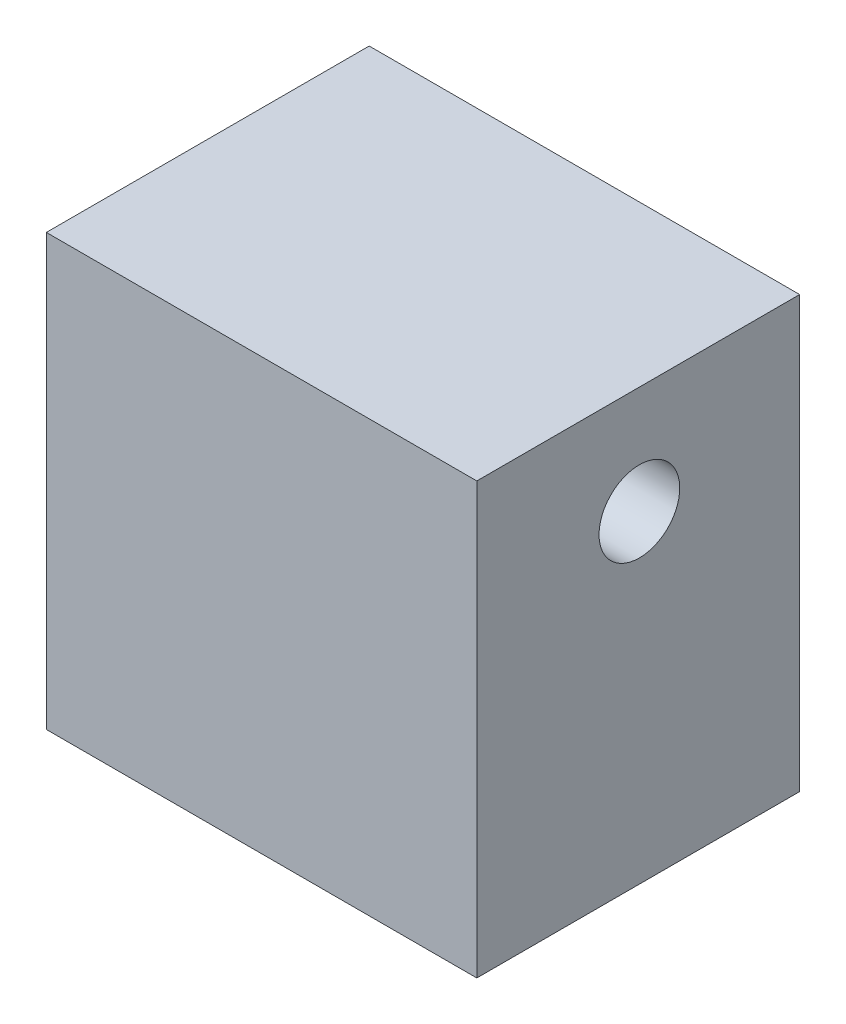
ISO-10303-21;
HEADER;
FILE_DESCRIPTION(('STEP AP214'),'2;1');
FILE_NAME('part.step','',(''),(''),'','','');
FILE_SCHEMA(('AUTOMOTIVE_DESIGN { 1 0 10303 214 1 1 1 1 }'));
ENDSEC;
DATA;
#1=APPLICATION_CONTEXT('core data for automotive mechanical design processes');
#2=APPLICATION_PROTOCOL_DEFINITION('international standard','automotive_design',2000,#1);
#3=PRODUCT_CONTEXT('',#1,'mechanical');
#4=PRODUCT('Part','Part','',(#3));
#5=PRODUCT_RELATED_PRODUCT_CATEGORY('part','',(#4));
#6=PRODUCT_DEFINITION_FORMATION('','',#4);
#7=PRODUCT_DEFINITION_CONTEXT('part definition',#1,'design');
#8=PRODUCT_DEFINITION('design','',#6,#7);
#9=PRODUCT_DEFINITION_SHAPE('','',#8);
#10=(LENGTH_UNIT() NAMED_UNIT(*) SI_UNIT(.MILLI.,.METRE.));
#11=(NAMED_UNIT(*) PLANE_ANGLE_UNIT() SI_UNIT($,.RADIAN.));
#12=(NAMED_UNIT(*) SI_UNIT($,.STERADIAN.) SOLID_ANGLE_UNIT());
#13=UNCERTAINTY_MEASURE_WITH_UNIT(LENGTH_MEASURE(1.E-05),#10,'distance_accuracy_value','');
#14=(GEOMETRIC_REPRESENTATION_CONTEXT(3) GLOBAL_UNCERTAINTY_ASSIGNED_CONTEXT((#13)) GLOBAL_UNIT_ASSIGNED_CONTEXT((#10,
#11,#12)) REPRESENTATION_CONTEXT('',''));
#15=CARTESIAN_POINT('',(0.,0.,0.));
#16=DIRECTION('',(0.,0.,1.));
#17=DIRECTION('',(1.,0.,0.));
#18=AXIS2_PLACEMENT_3D('',#15,#16,#17);
#19=CARTESIAN_POINT('',(-25.4,25.4,38.1));
#20=DIRECTION('',(1.,0.,0.));
#21=DIRECTION('',(0.,1.,0.));
#22=AXIS2_PLACEMENT_3D('',#19,#20,#21);
#23=PLANE('',#22);
#24=CARTESIAN_POINT('',(-25.4,12.7,18.9150285820291));
#25=DIRECTION('',(-1.,0.,0.));
#26=DIRECTION('',(0.,-1.,0.));
#27=AXIS2_PLACEMENT_3D('',#24,#25,#26);
#28=CIRCLE('',#27,4.7625);
#29=CARTESIAN_POINT('',(-25.4,7.9375,18.9150285820291));
#30=VERTEX_POINT('',#29);
#31=EDGE_CURVE('E116',#30,#30,#28,.T.);
#32=ORIENTED_EDGE('',*,*,#31,.F.);
#33=EDGE_LOOP('',(#32));
#34=FACE_BOUND('',#33,.T.);
#35=DIRECTION('',(0.,-1.,0.));
#36=VECTOR('',#35,1.);
#37=CARTESIAN_POINT('',(-25.4,25.4,0.));
#38=LINE('',#37,#36);
#39=CARTESIAN_POINT('',(-25.4,25.4,0.));
#40=VERTEX_POINT('',#39);
#41=CARTESIAN_POINT('',(-25.4,-25.4,0.));
#42=VERTEX_POINT('',#41);
#43=EDGE_CURVE('E96',#40,#42,#38,.T.);
#44=ORIENTED_EDGE('',*,*,#43,.T.);
#45=DIRECTION('',(0.,0.,-1.));
#46=VECTOR('',#45,1.);
#47=CARTESIAN_POINT('',(-25.4,-25.4,38.1));
#48=LINE('',#47,#46);
#49=CARTESIAN_POINT('',(-25.4,-25.4,38.1));
#50=VERTEX_POINT('',#49);
#51=EDGE_CURVE('E11',#50,#42,#48,.T.);
#52=ORIENTED_EDGE('',*,*,#51,.F.);
#53=DIRECTION('',(0.,-1.,0.));
#54=VECTOR('',#53,1.);
#55=CARTESIAN_POINT('',(-25.4,25.4,38.1));
#56=LINE('',#55,#54);
#57=CARTESIAN_POINT('',(-25.4,25.4,38.1));
#58=VERTEX_POINT('',#57);
#59=EDGE_CURVE('E84',#58,#50,#56,.T.);
#60=ORIENTED_EDGE('',*,*,#59,.F.);
#61=DIRECTION('',(0.,0.,-1.));
#62=VECTOR('',#61,1.);
#63=CARTESIAN_POINT('',(-25.4,25.4,38.1));
#64=LINE('',#63,#62);
#65=EDGE_CURVE('E92',#58,#40,#64,.T.);
#66=ORIENTED_EDGE('',*,*,#65,.T.);
#67=EDGE_LOOP('',(#44,#52,#60,#66));
#68=FACE_BOUND('',#67,.T.);
#69=ADVANCED_FACE('F33',(#34,#68),#23,.F.);
#70=CARTESIAN_POINT('',(25.4,-25.4,38.1));
#71=DIRECTION('',(0.,1.,0.));
#72=DIRECTION('',(-1.,0.,0.));
#73=AXIS2_PLACEMENT_3D('',#70,#71,#72);
#74=PLANE('',#73);
#75=CARTESIAN_POINT('',(0.,-25.4,19.05));
#76=DIRECTION('',(0.,-1.,0.));
#77=DIRECTION('',(1.,0.,0.));
#78=AXIS2_PLACEMENT_3D('',#75,#76,#77);
#79=CIRCLE('',#78,5.588);
#80=CARTESIAN_POINT('',(5.588,-25.4,19.05));
#81=VERTEX_POINT('',#80);
#82=EDGE_CURVE('E110',#81,#81,#79,.T.);
#83=ORIENTED_EDGE('',*,*,#82,.F.);
#84=EDGE_LOOP('',(#83));
#85=FACE_BOUND('',#84,.T.);
#86=DIRECTION('',(1.,0.,0.));
#87=VECTOR('',#86,1.);
#88=CARTESIAN_POINT('',(25.4,-25.4,0.));
#89=LINE('',#88,#87);
#90=CARTESIAN_POINT('',(25.4,-25.4,0.));
#91=VERTEX_POINT('',#90);
#92=EDGE_CURVE('E88',#42,#91,#89,.T.);
#93=ORIENTED_EDGE('',*,*,#92,.T.);
#94=DIRECTION('',(0.,0.,-1.));
#95=VECTOR('',#94,1.);
#96=CARTESIAN_POINT('',(25.4,-25.4,38.1));
#97=LINE('',#96,#95);
#98=CARTESIAN_POINT('',(25.4,-25.4,38.1));
#99=VERTEX_POINT('',#98);
#100=EDGE_CURVE('E41',#99,#91,#97,.T.);
#101=ORIENTED_EDGE('',*,*,#100,.F.);
#102=DIRECTION('',(1.,0.,0.));
#103=VECTOR('',#102,1.);
#104=CARTESIAN_POINT('',(25.4,-25.4,38.1));
#105=LINE('',#104,#103);
#106=EDGE_CURVE('E79',#50,#99,#105,.T.);
#107=ORIENTED_EDGE('',*,*,#106,.F.);
#108=ORIENTED_EDGE('',*,*,#51,.T.);
#109=EDGE_LOOP('',(#93,#101,#107,#108));
#110=FACE_BOUND('',#109,.T.);
#111=ADVANCED_FACE('F87',(#85,#110),#74,.F.);
#112=CARTESIAN_POINT('',(25.4,25.4,38.1));
#113=DIRECTION('',(-1.,0.,0.));
#114=DIRECTION('',(0.,-1.,0.));
#115=AXIS2_PLACEMENT_3D('',#112,#113,#114);
#116=PLANE('',#115);
#117=CARTESIAN_POINT('',(25.4,12.7,18.9150285820291));
#118=DIRECTION('',(-1.,0.,0.));
#119=DIRECTION('',(0.,-1.,0.));
#120=AXIS2_PLACEMENT_3D('',#117,#118,#119);
#121=CIRCLE('',#120,4.7625);
#122=CARTESIAN_POINT('',(25.4,7.93750000000001,18.9150285820291));
#123=VERTEX_POINT('',#122);
#124=EDGE_CURVE('E113',#123,#123,#121,.T.);
#125=ORIENTED_EDGE('',*,*,#124,.T.);
#126=EDGE_LOOP('',(#125));
#127=FACE_BOUND('',#126,.T.);
#128=DIRECTION('',(0.,1.,0.));
#129=VECTOR('',#128,1.);
#130=CARTESIAN_POINT('',(25.4,25.4,0.));
#131=LINE('',#130,#129);
#132=CARTESIAN_POINT('',(25.4,25.4,0.));
#133=VERTEX_POINT('',#132);
#134=EDGE_CURVE('E66',#91,#133,#131,.T.);
#135=ORIENTED_EDGE('',*,*,#134,.T.);
#136=DIRECTION('',(0.,0.,-1.));
#137=VECTOR('',#136,1.);
#138=CARTESIAN_POINT('',(25.4,25.4,38.1));
#139=LINE('',#138,#137);
#140=CARTESIAN_POINT('',(25.4,25.4,38.1));
#141=VERTEX_POINT('',#140);
#142=EDGE_CURVE('E89',#141,#133,#139,.T.);
#143=ORIENTED_EDGE('',*,*,#142,.F.);
#144=DIRECTION('',(0.,1.,0.));
#145=VECTOR('',#144,1.);
#146=CARTESIAN_POINT('',(25.4,25.4,38.1));
#147=LINE('',#146,#145);
#148=EDGE_CURVE('E82',#99,#141,#147,.T.);
#149=ORIENTED_EDGE('',*,*,#148,.F.);
#150=ORIENTED_EDGE('',*,*,#100,.T.);
#151=EDGE_LOOP('',(#135,#143,#149,#150));
#152=FACE_BOUND('',#151,.T.);
#153=ADVANCED_FACE('F90',(#127,#152),#116,.F.);
#154=CARTESIAN_POINT('',(25.4,25.4,38.1));
#155=DIRECTION('',(0.,-1.,0.));
#156=DIRECTION('',(1.,0.,0.));
#157=AXIS2_PLACEMENT_3D('',#154,#155,#156);
#158=PLANE('',#157);
#159=DIRECTION('',(-1.,0.,0.));
#160=VECTOR('',#159,1.);
#161=CARTESIAN_POINT('',(25.4,25.4,0.));
#162=LINE('',#161,#160);
#163=EDGE_CURVE('E72',#133,#40,#162,.T.);
#164=ORIENTED_EDGE('',*,*,#163,.T.);
#165=ORIENTED_EDGE('',*,*,#65,.F.);
#166=DIRECTION('',(-1.,0.,0.));
#167=VECTOR('',#166,1.);
#168=CARTESIAN_POINT('',(25.4,25.4,38.1));
#169=LINE('',#168,#167);
#170=EDGE_CURVE('E49',#141,#58,#169,.T.);
#171=ORIENTED_EDGE('',*,*,#170,.F.);
#172=ORIENTED_EDGE('',*,*,#142,.T.);
#173=EDGE_LOOP('',(#164,#165,#171,#172));
#174=FACE_BOUND('',#173,.T.);
#175=ADVANCED_FACE('F104',(#174),#158,.F.);
#176=CARTESIAN_POINT('',(0.,0.,38.1));
#177=DIRECTION('',(0.,0.,-1.));
#178=DIRECTION('',(-1.,0.,0.));
#179=AXIS2_PLACEMENT_3D('',#176,#177,#178);
#180=PLANE('',#179);
#181=ORIENTED_EDGE('',*,*,#59,.T.);
#182=ORIENTED_EDGE('',*,*,#106,.T.);
#183=ORIENTED_EDGE('',*,*,#148,.T.);
#184=ORIENTED_EDGE('',*,*,#170,.T.);
#185=EDGE_LOOP('',(#181,#182,#183,#184));
#186=FACE_BOUND('',#185,.T.);
#187=ADVANCED_FACE('F80',(#186),#180,.F.);
#188=CARTESIAN_POINT('',(0.,0.,0.));
#189=DIRECTION('',(0.,0.,-1.));
#190=DIRECTION('',(-1.,0.,0.));
#191=AXIS2_PLACEMENT_3D('',#188,#189,#190);
#192=PLANE('',#191);
#193=ORIENTED_EDGE('',*,*,#43,.F.);
#194=ORIENTED_EDGE('',*,*,#163,.F.);
#195=ORIENTED_EDGE('',*,*,#134,.F.);
#196=ORIENTED_EDGE('',*,*,#92,.F.);
#197=EDGE_LOOP('',(#193,#194,#195,#196));
#198=FACE_BOUND('',#197,.T.);
#199=ADVANCED_FACE('F107',(#198),#192,.T.);
#200=CARTESIAN_POINT('',(0.,0.,19.05));
#201=DIRECTION('',(0.,-1.,0.));
#202=DIRECTION('',(1.,0.,0.));
#203=AXIS2_PLACEMENT_3D('',#200,#201,#202);
#204=CYLINDRICAL_SURFACE('',#203,5.588);
#205=CARTESIAN_POINT('',(0.,0.,19.05));
#206=DIRECTION('',(0.,-1.,0.));
#207=DIRECTION('',(1.,0.,0.));
#208=AXIS2_PLACEMENT_3D('',#205,#206,#207);
#209=CIRCLE('',#208,5.588);
#210=CARTESIAN_POINT('',(5.588,0.,19.05));
#211=VERTEX_POINT('',#210);
#212=EDGE_CURVE('E99',#211,#211,#209,.T.);
#213=ORIENTED_EDGE('',*,*,#212,.F.);
#214=EDGE_LOOP('',(#213));
#215=FACE_BOUND('',#214,.T.);
#216=ORIENTED_EDGE('',*,*,#82,.T.);
#217=EDGE_LOOP('',(#216));
#218=FACE_BOUND('',#217,.T.);
#219=ADVANCED_FACE('F145',(#215,#218),#204,.F.);
#220=CARTESIAN_POINT('',(0.,0.,19.05));
#221=DIRECTION('',(0.,-1.,0.));
#222=DIRECTION('',(1.,0.,0.));
#223=AXIS2_PLACEMENT_3D('',#220,#221,#222);
#224=PLANE('',#223);
#225=ORIENTED_EDGE('',*,*,#212,.T.);
#226=EDGE_LOOP('',(#225));
#227=FACE_BOUND('',#226,.T.);
#228=ADVANCED_FACE('F126',(#227),#224,.T.);
#229=CARTESIAN_POINT('',(25.4,12.7,18.9150285820291));
#230=DIRECTION('',(-1.,0.,0.));
#231=DIRECTION('',(0.,-1.,0.));
#232=AXIS2_PLACEMENT_3D('',#229,#230,#231);
#233=CYLINDRICAL_SURFACE('',#232,4.7625);
#234=ORIENTED_EDGE('',*,*,#124,.F.);
#235=EDGE_LOOP('',(#234));
#236=FACE_BOUND('',#235,.T.);
#237=ORIENTED_EDGE('',*,*,#31,.T.);
#238=EDGE_LOOP('',(#237));
#239=FACE_BOUND('',#238,.T.);
#240=ADVANCED_FACE('F123',(#236,#239),#233,.F.);
#241=CLOSED_SHELL('',(#69,#111,#153,#175,#187,#199,#219,#228,#240));
#242=MANIFOLD_SOLID_BREP('B2',#241);
#243=ADVANCED_BREP_SHAPE_REPRESENTATION('',(#18,#242),#14);
#244=SHAPE_DEFINITION_REPRESENTATION(#9,#243);
ENDSEC;
END-ISO-10303-21;
